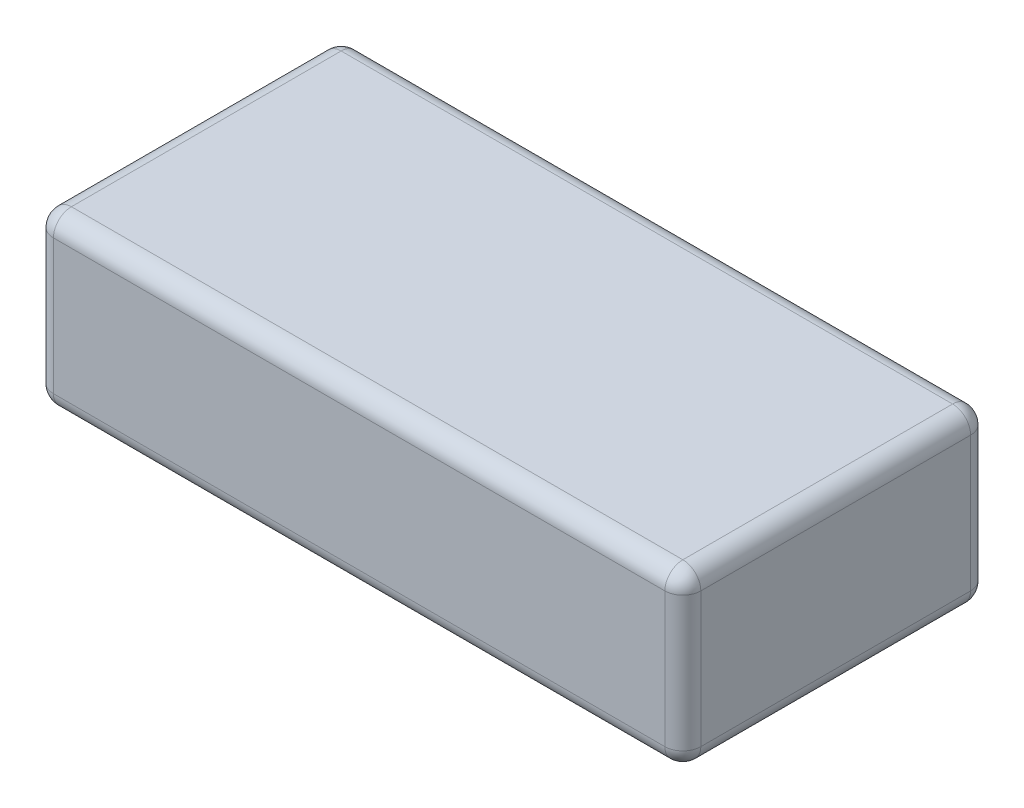
ISO-10303-21;
HEADER;
FILE_DESCRIPTION(('STEP AP214'),'2;1');
FILE_NAME('part.step','',(''),(''),'','','');
FILE_SCHEMA(('AUTOMOTIVE_DESIGN { 1 0 10303 214 1 1 1 1 }'));
ENDSEC;
DATA;
#1=APPLICATION_CONTEXT('core data for automotive mechanical design processes');
#2=APPLICATION_PROTOCOL_DEFINITION('international standard','automotive_design',2000,#1);
#3=PRODUCT_CONTEXT('',#1,'mechanical');
#4=PRODUCT('Part','Part','',(#3));
#5=PRODUCT_RELATED_PRODUCT_CATEGORY('part','',(#4));
#6=PRODUCT_DEFINITION_FORMATION('','',#4);
#7=PRODUCT_DEFINITION_CONTEXT('part definition',#1,'design');
#8=PRODUCT_DEFINITION('design','',#6,#7);
#9=PRODUCT_DEFINITION_SHAPE('','',#8);
#10=(LENGTH_UNIT() NAMED_UNIT(*) SI_UNIT(.MILLI.,.METRE.));
#11=(NAMED_UNIT(*) PLANE_ANGLE_UNIT() SI_UNIT($,.RADIAN.));
#12=(NAMED_UNIT(*) SI_UNIT($,.STERADIAN.) SOLID_ANGLE_UNIT());
#13=UNCERTAINTY_MEASURE_WITH_UNIT(LENGTH_MEASURE(1.E-05),#10,'distance_accuracy_value','');
#14=(GEOMETRIC_REPRESENTATION_CONTEXT(3) GLOBAL_UNCERTAINTY_ASSIGNED_CONTEXT((#13)) GLOBAL_UNIT_ASSIGNED_CONTEXT((#10,
#11,#12)) REPRESENTATION_CONTEXT('',''));
#15=CARTESIAN_POINT('',(0.,0.,0.));
#16=DIRECTION('',(0.,0.,1.));
#17=DIRECTION('',(1.,0.,0.));
#18=AXIS2_PLACEMENT_3D('',#15,#16,#17);
#19=CARTESIAN_POINT('',(36.,19.,17.));
#20=DIRECTION('',(-1.,0.,0.));
#21=DIRECTION('',(0.,0.,1.));
#22=AXIS2_PLACEMENT_3D('',#19,#20,#21);
#23=PLANE('',#22);
#24=DIRECTION('',(0.,0.,-1.));
#25=VECTOR('',#24,1.);
#26=CARTESIAN_POINT('',(36.,2.,-17.));
#27=LINE('',#26,#25);
#28=CARTESIAN_POINT('',(36.,2.,15.));
#29=VERTEX_POINT('',#28);
#30=CARTESIAN_POINT('',(36.,2.,-15.));
#31=VERTEX_POINT('',#30);
#32=EDGE_CURVE('E250',#29,#31,#27,.T.);
#33=ORIENTED_EDGE('',*,*,#32,.T.);
#34=DIRECTION('',(0.,-1.,0.));
#35=VECTOR('',#34,1.);
#36=CARTESIAN_POINT('',(36.,19.,-15.));
#37=LINE('',#36,#35);
#38=CARTESIAN_POINT('',(36.,17.,-15.));
#39=VERTEX_POINT('',#38);
#40=EDGE_CURVE('E255',#31,#39,#37,.F.);
#41=ORIENTED_EDGE('',*,*,#40,.T.);
#42=DIRECTION('',(0.,0.,-1.));
#43=VECTOR('',#42,1.);
#44=CARTESIAN_POINT('',(36.,17.,17.));
#45=LINE('',#44,#43);
#46=CARTESIAN_POINT('',(36.,17.,15.));
#47=VERTEX_POINT('',#46);
#48=EDGE_CURVE('E251',#39,#47,#45,.F.);
#49=ORIENTED_EDGE('',*,*,#48,.T.);
#50=DIRECTION('',(0.,-1.,0.));
#51=VECTOR('',#50,1.);
#52=CARTESIAN_POINT('',(36.,19.,15.));
#53=LINE('',#52,#51);
#54=EDGE_CURVE('E246',#47,#29,#53,.T.);
#55=ORIENTED_EDGE('',*,*,#54,.T.);
#56=EDGE_LOOP('',(#33,#41,#49,#55));
#57=FACE_BOUND('',#56,.T.);
#58=ADVANCED_FACE('F44',(#57),#23,.F.);
#59=CARTESIAN_POINT('',(-36.,19.,-17.));
#60=DIRECTION('',(0.,0.,1.));
#61=DIRECTION('',(1.,0.,0.));
#62=AXIS2_PLACEMENT_3D('',#59,#60,#61);
#63=PLANE('',#62);
#64=DIRECTION('',(0.,-1.,0.));
#65=VECTOR('',#64,1.);
#66=CARTESIAN_POINT('',(34.,19.,-17.));
#67=LINE('',#66,#65);
#68=CARTESIAN_POINT('',(34.,17.,-17.));
#69=VERTEX_POINT('',#68);
#70=CARTESIAN_POINT('',(34.,2.,-17.));
#71=VERTEX_POINT('',#70);
#72=EDGE_CURVE('E144',#69,#71,#67,.T.);
#73=ORIENTED_EDGE('',*,*,#72,.T.);
#74=DIRECTION('',(-1.,0.,0.));
#75=VECTOR('',#74,1.);
#76=CARTESIAN_POINT('',(-36.,2.,-17.));
#77=LINE('',#76,#75);
#78=CARTESIAN_POINT('',(-34.,2.,-17.));
#79=VERTEX_POINT('',#78);
#80=EDGE_CURVE('E139',#71,#79,#77,.T.);
#81=ORIENTED_EDGE('',*,*,#80,.T.);
#82=DIRECTION('',(0.,-1.,0.));
#83=VECTOR('',#82,1.);
#84=CARTESIAN_POINT('',(-34.,19.,-17.));
#85=LINE('',#84,#83);
#86=CARTESIAN_POINT('',(-34.,17.,-17.));
#87=VERTEX_POINT('',#86);
#88=EDGE_CURVE('E133',#79,#87,#85,.F.);
#89=ORIENTED_EDGE('',*,*,#88,.T.);
#90=DIRECTION('',(-1.,0.,0.));
#91=VECTOR('',#90,1.);
#92=CARTESIAN_POINT('',(-36.,17.,-17.));
#93=LINE('',#92,#91);
#94=EDGE_CURVE('E136',#87,#69,#93,.F.);
#95=ORIENTED_EDGE('',*,*,#94,.T.);
#96=EDGE_LOOP('',(#73,#81,#89,#95));
#97=FACE_BOUND('',#96,.T.);
#98=ADVANCED_FACE('F135',(#97),#63,.F.);
#99=CARTESIAN_POINT('',(-36.,19.,17.));
#100=DIRECTION('',(1.,0.,0.));
#101=DIRECTION('',(0.,0.,-1.));
#102=AXIS2_PLACEMENT_3D('',#99,#100,#101);
#103=PLANE('',#102);
#104=DIRECTION('',(0.,0.,1.));
#105=VECTOR('',#104,1.);
#106=CARTESIAN_POINT('',(-36.,17.,17.));
#107=LINE('',#106,#105);
#108=CARTESIAN_POINT('',(-36.,17.,15.));
#109=VERTEX_POINT('',#108);
#110=CARTESIAN_POINT('',(-36.,17.,-15.));
#111=VERTEX_POINT('',#110);
#112=EDGE_CURVE('E264',#109,#111,#107,.F.);
#113=ORIENTED_EDGE('',*,*,#112,.T.);
#114=DIRECTION('',(0.,-1.,0.));
#115=VECTOR('',#114,1.);
#116=CARTESIAN_POINT('',(-36.,19.,-15.));
#117=LINE('',#116,#115);
#118=CARTESIAN_POINT('',(-36.,2.,-15.));
#119=VERTEX_POINT('',#118);
#120=EDGE_CURVE('E168',#111,#119,#117,.T.);
#121=ORIENTED_EDGE('',*,*,#120,.T.);
#122=DIRECTION('',(0.,0.,1.));
#123=VECTOR('',#122,1.);
#124=CARTESIAN_POINT('',(-36.,2.,17.));
#125=LINE('',#124,#123);
#126=CARTESIAN_POINT('',(-36.,2.,15.));
#127=VERTEX_POINT('',#126);
#128=EDGE_CURVE('E270',#119,#127,#125,.T.);
#129=ORIENTED_EDGE('',*,*,#128,.T.);
#130=DIRECTION('',(0.,-1.,0.));
#131=VECTOR('',#130,1.);
#132=CARTESIAN_POINT('',(-36.,19.,15.));
#133=LINE('',#132,#131);
#134=EDGE_CURVE('E267',#127,#109,#133,.F.);
#135=ORIENTED_EDGE('',*,*,#134,.T.);
#136=EDGE_LOOP('',(#113,#121,#129,#135));
#137=FACE_BOUND('',#136,.T.);
#138=ADVANCED_FACE('F384',(#137),#103,.F.);
#139=CARTESIAN_POINT('',(-36.,19.,17.));
#140=DIRECTION('',(0.,0.,-1.));
#141=DIRECTION('',(-1.,0.,0.));
#142=AXIS2_PLACEMENT_3D('',#139,#140,#141);
#143=PLANE('',#142);
#144=DIRECTION('',(0.,-1.,0.));
#145=VECTOR('',#144,1.);
#146=CARTESIAN_POINT('',(-34.,19.,17.));
#147=LINE('',#146,#145);
#148=CARTESIAN_POINT('',(-34.,17.,17.));
#149=VERTEX_POINT('',#148);
#150=CARTESIAN_POINT('',(-34.,2.,17.));
#151=VERTEX_POINT('',#150);
#152=EDGE_CURVE('E280',#149,#151,#147,.T.);
#153=ORIENTED_EDGE('',*,*,#152,.T.);
#154=DIRECTION('',(1.,0.,0.));
#155=VECTOR('',#154,1.);
#156=CARTESIAN_POINT('',(36.,2.,17.));
#157=LINE('',#156,#155);
#158=CARTESIAN_POINT('',(34.,2.,17.));
#159=VERTEX_POINT('',#158);
#160=EDGE_CURVE('E284',#151,#159,#157,.T.);
#161=ORIENTED_EDGE('',*,*,#160,.T.);
#162=DIRECTION('',(0.,-1.,0.));
#163=VECTOR('',#162,1.);
#164=CARTESIAN_POINT('',(34.,19.,17.));
#165=LINE('',#164,#163);
#166=CARTESIAN_POINT('',(34.,17.,17.));
#167=VERTEX_POINT('',#166);
#168=EDGE_CURVE('E244',#159,#167,#165,.F.);
#169=ORIENTED_EDGE('',*,*,#168,.T.);
#170=DIRECTION('',(1.,0.,0.));
#171=VECTOR('',#170,1.);
#172=CARTESIAN_POINT('',(-36.,17.,17.));
#173=LINE('',#172,#171);
#174=EDGE_CURVE('E275',#167,#149,#173,.F.);
#175=ORIENTED_EDGE('',*,*,#174,.T.);
#176=EDGE_LOOP('',(#153,#161,#169,#175));
#177=FACE_BOUND('',#176,.T.);
#178=ADVANCED_FACE('F362',(#177),#143,.F.);
#179=CARTESIAN_POINT('',(0.,19.,0.));
#180=DIRECTION('',(0.,-1.,0.));
#181=DIRECTION('',(0.,0.,-1.));
#182=AXIS2_PLACEMENT_3D('',#179,#180,#181);
#183=PLANE('',#182);
#184=DIRECTION('',(0.,0.,1.));
#185=VECTOR('',#184,1.);
#186=CARTESIAN_POINT('',(-34.,19.,0.));
#187=LINE('',#186,#185);
#188=CARTESIAN_POINT('',(-34.,19.,-15.));
#189=VERTEX_POINT('',#188);
#190=CARTESIAN_POINT('',(-34.,19.,15.));
#191=VERTEX_POINT('',#190);
#192=EDGE_CURVE('E54',#189,#191,#187,.T.);
#193=ORIENTED_EDGE('',*,*,#192,.T.);
#194=DIRECTION('',(1.,0.,0.));
#195=VECTOR('',#194,1.);
#196=CARTESIAN_POINT('',(0.,19.,15.));
#197=LINE('',#196,#195);
#198=CARTESIAN_POINT('',(34.,19.,15.));
#199=VERTEX_POINT('',#198);
#200=EDGE_CURVE('E11',#191,#199,#197,.T.);
#201=ORIENTED_EDGE('',*,*,#200,.T.);
#202=DIRECTION('',(0.,0.,-1.));
#203=VECTOR('',#202,1.);
#204=CARTESIAN_POINT('',(34.,19.,0.));
#205=LINE('',#204,#203);
#206=CARTESIAN_POINT('',(34.,19.,-15.));
#207=VERTEX_POINT('',#206);
#208=EDGE_CURVE('E287',#199,#207,#205,.T.);
#209=ORIENTED_EDGE('',*,*,#208,.T.);
#210=DIRECTION('',(-1.,0.,0.));
#211=VECTOR('',#210,1.);
#212=CARTESIAN_POINT('',(0.,19.,-15.));
#213=LINE('',#212,#211);
#214=EDGE_CURVE('E65',#207,#189,#213,.T.);
#215=ORIENTED_EDGE('',*,*,#214,.T.);
#216=EDGE_LOOP('',(#193,#201,#209,#215));
#217=FACE_BOUND('',#216,.T.);
#218=ADVANCED_FACE('F352',(#217),#183,.F.);
#219=CARTESIAN_POINT('',(0.,0.,0.));
#220=DIRECTION('',(0.,-1.,0.));
#221=DIRECTION('',(0.,0.,-1.));
#222=AXIS2_PLACEMENT_3D('',#219,#220,#221);
#223=PLANE('',#222);
#224=DIRECTION('',(0.,0.,1.));
#225=VECTOR('',#224,1.);
#226=CARTESIAN_POINT('',(-34.,0.,-17.));
#227=LINE('',#226,#225);
#228=CARTESIAN_POINT('',(-34.,0.,15.));
#229=VERTEX_POINT('',#228);
#230=CARTESIAN_POINT('',(-34.,0.,-15.));
#231=VERTEX_POINT('',#230);
#232=EDGE_CURVE('E326',#229,#231,#227,.F.);
#233=ORIENTED_EDGE('',*,*,#232,.T.);
#234=DIRECTION('',(-1.,0.,0.));
#235=VECTOR('',#234,1.);
#236=CARTESIAN_POINT('',(36.,0.,-15.));
#237=LINE('',#236,#235);
#238=CARTESIAN_POINT('',(34.,0.,-15.));
#239=VERTEX_POINT('',#238);
#240=EDGE_CURVE('E257',#231,#239,#237,.F.);
#241=ORIENTED_EDGE('',*,*,#240,.T.);
#242=DIRECTION('',(0.,0.,-1.));
#243=VECTOR('',#242,1.);
#244=CARTESIAN_POINT('',(34.,0.,17.));
#245=LINE('',#244,#243);
#246=CARTESIAN_POINT('',(34.,0.,15.));
#247=VERTEX_POINT('',#246);
#248=EDGE_CURVE('E320',#239,#247,#245,.F.);
#249=ORIENTED_EDGE('',*,*,#248,.T.);
#250=DIRECTION('',(1.,0.,0.));
#251=VECTOR('',#250,1.);
#252=CARTESIAN_POINT('',(-36.,0.,15.));
#253=LINE('',#252,#251);
#254=EDGE_CURVE('E338',#247,#229,#253,.F.);
#255=ORIENTED_EDGE('',*,*,#254,.T.);
#256=EDGE_LOOP('',(#233,#241,#249,#255));
#257=FACE_BOUND('',#256,.T.);
#258=ADVANCED_FACE('F329',(#257),#223,.T.);
#259=CARTESIAN_POINT('',(0.,17.,15.));
#260=DIRECTION('',(1.,0.,0.));
#261=DIRECTION('',(0.,0.,-1.));
#262=AXIS2_PLACEMENT_3D('',#259,#260,#261);
#263=CYLINDRICAL_SURFACE('',#262,2.);
#264=CARTESIAN_POINT('',(34.,17.,15.));
#265=DIRECTION('',(1.,0.,0.));
#266=DIRECTION('',(0.,0.,-1.));
#267=AXIS2_PLACEMENT_3D('',#264,#265,#266);
#268=CIRCLE('',#267,2.);
#269=EDGE_CURVE('E48',#199,#167,#268,.T.);
#270=ORIENTED_EDGE('',*,*,#269,.F.);
#271=ORIENTED_EDGE('',*,*,#200,.F.);
#272=CARTESIAN_POINT('',(-34.,17.,15.));
#273=DIRECTION('',(-1.,0.,0.));
#274=DIRECTION('',(0.,0.,1.));
#275=AXIS2_PLACEMENT_3D('',#272,#273,#274);
#276=CIRCLE('',#275,2.);
#277=EDGE_CURVE('E223',#149,#191,#276,.T.);
#278=ORIENTED_EDGE('',*,*,#277,.F.);
#279=ORIENTED_EDGE('',*,*,#174,.F.);
#280=EDGE_LOOP('',(#270,#271,#278,#279));
#281=FACE_BOUND('',#280,.T.);
#282=ADVANCED_FACE('F46',(#281),#263,.T.);
#283=CARTESIAN_POINT('',(34.,17.,15.));
#284=DIRECTION('',(0.,0.,1.));
#285=DIRECTION('',(1.,0.,0.));
#286=AXIS2_PLACEMENT_3D('',#283,#284,#285);
#287=SPHERICAL_SURFACE('',#286,2.);
#288=CARTESIAN_POINT('',(34.,17.,15.));
#289=DIRECTION('',(0.,0.,1.));
#290=DIRECTION('',(1.,0.,0.));
#291=AXIS2_PLACEMENT_3D('',#288,#289,#290);
#292=CIRCLE('',#291,2.);
#293=EDGE_CURVE('E216',#199,#47,#292,.F.);
#294=ORIENTED_EDGE('',*,*,#293,.F.);
#295=ORIENTED_EDGE('',*,*,#269,.T.);
#296=CARTESIAN_POINT('',(34.,17.,15.));
#297=DIRECTION('',(0.,1.,0.));
#298=DIRECTION('',(0.,0.,1.));
#299=AXIS2_PLACEMENT_3D('',#296,#297,#298);
#300=CIRCLE('',#299,2.);
#301=EDGE_CURVE('E220',#47,#167,#300,.F.);
#302=ORIENTED_EDGE('',*,*,#301,.F.);
#303=EDGE_LOOP('',(#294,#295,#302));
#304=FACE_BOUND('',#303,.T.);
#305=ADVANCED_FACE('F236',(#304),#287,.T.);
#306=CARTESIAN_POINT('',(-34.,17.,15.));
#307=DIRECTION('',(0.,1.,0.));
#308=DIRECTION('',(0.,0.,1.));
#309=AXIS2_PLACEMENT_3D('',#306,#307,#308);
#310=SPHERICAL_SURFACE('',#309,2.);
#311=CARTESIAN_POINT('',(-34.,17.,15.));
#312=DIRECTION('',(0.,1.,0.));
#313=DIRECTION('',(0.,0.,1.));
#314=AXIS2_PLACEMENT_3D('',#311,#312,#313);
#315=CIRCLE('',#314,2.);
#316=EDGE_CURVE('E208',#149,#109,#315,.F.);
#317=ORIENTED_EDGE('',*,*,#316,.F.);
#318=ORIENTED_EDGE('',*,*,#277,.T.);
#319=CARTESIAN_POINT('',(-34.,17.,15.));
#320=DIRECTION('',(0.,0.,1.));
#321=DIRECTION('',(1.,0.,0.));
#322=AXIS2_PLACEMENT_3D('',#319,#320,#321);
#323=CIRCLE('',#322,2.);
#324=EDGE_CURVE('E212',#109,#191,#323,.F.);
#325=ORIENTED_EDGE('',*,*,#324,.F.);
#326=EDGE_LOOP('',(#317,#318,#325));
#327=FACE_BOUND('',#326,.T.);
#328=ADVANCED_FACE('F354',(#327),#310,.T.);
#329=CARTESIAN_POINT('',(34.,19.,15.));
#330=DIRECTION('',(0.,-1.,0.));
#331=DIRECTION('',(0.,0.,-1.));
#332=AXIS2_PLACEMENT_3D('',#329,#330,#331);
#333=CYLINDRICAL_SURFACE('',#332,2.);
#334=ORIENTED_EDGE('',*,*,#301,.T.);
#335=ORIENTED_EDGE('',*,*,#168,.F.);
#336=CARTESIAN_POINT('',(34.,2.,15.));
#337=DIRECTION('',(0.,-1.,0.));
#338=DIRECTION('',(0.,0.,-1.));
#339=AXIS2_PLACEMENT_3D('',#336,#337,#338);
#340=CIRCLE('',#339,2.);
#341=EDGE_CURVE('E200',#29,#159,#340,.T.);
#342=ORIENTED_EDGE('',*,*,#341,.F.);
#343=ORIENTED_EDGE('',*,*,#54,.F.);
#344=EDGE_LOOP('',(#334,#335,#342,#343));
#345=FACE_BOUND('',#344,.T.);
#346=ADVANCED_FACE('F242',(#345),#333,.T.);
#347=CARTESIAN_POINT('',(34.,17.,0.));
#348=DIRECTION('',(0.,0.,-1.));
#349=DIRECTION('',(-1.,0.,0.));
#350=AXIS2_PLACEMENT_3D('',#347,#348,#349);
#351=CYLINDRICAL_SURFACE('',#350,2.);
#352=ORIENTED_EDGE('',*,*,#293,.T.);
#353=ORIENTED_EDGE('',*,*,#48,.F.);
#354=CARTESIAN_POINT('',(34.,17.,-15.));
#355=DIRECTION('',(0.,0.,-1.));
#356=DIRECTION('',(-1.,0.,0.));
#357=AXIS2_PLACEMENT_3D('',#354,#355,#356);
#358=CIRCLE('',#357,2.);
#359=EDGE_CURVE('E196',#207,#39,#358,.T.);
#360=ORIENTED_EDGE('',*,*,#359,.F.);
#361=ORIENTED_EDGE('',*,*,#208,.F.);
#362=EDGE_LOOP('',(#352,#353,#360,#361));
#363=FACE_BOUND('',#362,.T.);
#364=ADVANCED_FACE('F351',(#363),#351,.T.);
#365=CARTESIAN_POINT('',(0.,17.,-15.));
#366=DIRECTION('',(-1.,0.,0.));
#367=DIRECTION('',(0.,0.,1.));
#368=AXIS2_PLACEMENT_3D('',#365,#366,#367);
#369=CYLINDRICAL_SURFACE('',#368,2.);
#370=CARTESIAN_POINT('',(-34.,17.,-15.));
#371=DIRECTION('',(-1.,0.,0.));
#372=DIRECTION('',(0.,0.,1.));
#373=AXIS2_PLACEMENT_3D('',#370,#371,#372);
#374=CIRCLE('',#373,2.);
#375=EDGE_CURVE('E150',#189,#87,#374,.T.);
#376=ORIENTED_EDGE('',*,*,#375,.F.);
#377=ORIENTED_EDGE('',*,*,#214,.F.);
#378=CARTESIAN_POINT('',(34.,17.,-15.));
#379=DIRECTION('',(1.,0.,0.));
#380=DIRECTION('',(0.,0.,-1.));
#381=AXIS2_PLACEMENT_3D('',#378,#379,#380);
#382=CIRCLE('',#381,2.);
#383=EDGE_CURVE('E153',#69,#207,#382,.T.);
#384=ORIENTED_EDGE('',*,*,#383,.F.);
#385=ORIENTED_EDGE('',*,*,#94,.F.);
#386=EDGE_LOOP('',(#376,#377,#384,#385));
#387=FACE_BOUND('',#386,.T.);
#388=ADVANCED_FACE('F149',(#387),#369,.T.);
#389=CARTESIAN_POINT('',(-34.,17.,0.));
#390=DIRECTION('',(0.,0.,1.));
#391=DIRECTION('',(1.,0.,0.));
#392=AXIS2_PLACEMENT_3D('',#389,#390,#391);
#393=CYLINDRICAL_SURFACE('',#392,2.);
#394=ORIENTED_EDGE('',*,*,#324,.T.);
#395=ORIENTED_EDGE('',*,*,#192,.F.);
#396=CARTESIAN_POINT('',(-34.,17.,-15.));
#397=DIRECTION('',(0.,0.,-1.));
#398=DIRECTION('',(0.,1.,0.));
#399=AXIS2_PLACEMENT_3D('',#396,#397,#398);
#400=CIRCLE('',#399,2.);
#401=EDGE_CURVE('E163',#111,#189,#400,.T.);
#402=ORIENTED_EDGE('',*,*,#401,.F.);
#403=ORIENTED_EDGE('',*,*,#112,.F.);
#404=EDGE_LOOP('',(#394,#395,#402,#403));
#405=FACE_BOUND('',#404,.T.);
#406=ADVANCED_FACE('F512',(#405),#393,.T.);
#407=CARTESIAN_POINT('',(-34.,19.,15.));
#408=DIRECTION('',(0.,-1.,0.));
#409=DIRECTION('',(0.,0.,-1.));
#410=AXIS2_PLACEMENT_3D('',#407,#408,#409);
#411=CYLINDRICAL_SURFACE('',#410,2.);
#412=ORIENTED_EDGE('',*,*,#316,.T.);
#413=ORIENTED_EDGE('',*,*,#134,.F.);
#414=CARTESIAN_POINT('',(-34.,2.,15.));
#415=DIRECTION('',(0.,-1.,0.));
#416=DIRECTION('',(0.,0.,-1.));
#417=AXIS2_PLACEMENT_3D('',#414,#415,#416);
#418=CIRCLE('',#417,2.);
#419=EDGE_CURVE('E188',#151,#127,#418,.T.);
#420=ORIENTED_EDGE('',*,*,#419,.F.);
#421=ORIENTED_EDGE('',*,*,#152,.F.);
#422=EDGE_LOOP('',(#412,#413,#420,#421));
#423=FACE_BOUND('',#422,.T.);
#424=ADVANCED_FACE('F359',(#423),#411,.T.);
#425=CARTESIAN_POINT('',(-36.,2.,15.));
#426=DIRECTION('',(-1.,0.,0.));
#427=DIRECTION('',(0.,0.,1.));
#428=AXIS2_PLACEMENT_3D('',#425,#426,#427);
#429=CYLINDRICAL_SURFACE('',#428,2.);
#430=CARTESIAN_POINT('',(34.,2.,15.));
#431=DIRECTION('',(1.,0.,0.));
#432=DIRECTION('',(0.,0.,-1.));
#433=AXIS2_PLACEMENT_3D('',#430,#431,#432);
#434=CIRCLE('',#433,2.);
#435=EDGE_CURVE('E204',#159,#247,#434,.T.);
#436=ORIENTED_EDGE('',*,*,#435,.F.);
#437=ORIENTED_EDGE('',*,*,#160,.F.);
#438=CARTESIAN_POINT('',(-34.,2.,15.));
#439=DIRECTION('',(-1.,0.,0.));
#440=DIRECTION('',(0.,0.,1.));
#441=AXIS2_PLACEMENT_3D('',#438,#439,#440);
#442=CIRCLE('',#441,2.);
#443=EDGE_CURVE('E185',#229,#151,#442,.T.);
#444=ORIENTED_EDGE('',*,*,#443,.F.);
#445=ORIENTED_EDGE('',*,*,#254,.F.);
#446=EDGE_LOOP('',(#436,#437,#444,#445));
#447=FACE_BOUND('',#446,.T.);
#448=ADVANCED_FACE('F365',(#447),#429,.T.);
#449=CARTESIAN_POINT('',(34.,2.,15.));
#450=DIRECTION('',(0.,0.,1.));
#451=DIRECTION('',(0.,-1.,0.));
#452=AXIS2_PLACEMENT_3D('',#449,#450,#451);
#453=SPHERICAL_SURFACE('',#452,2.);
#454=ORIENTED_EDGE('',*,*,#341,.T.);
#455=ORIENTED_EDGE('',*,*,#435,.T.);
#456=CARTESIAN_POINT('',(34.,2.,15.));
#457=DIRECTION('',(0.,0.,1.));
#458=DIRECTION('',(1.,0.,0.));
#459=AXIS2_PLACEMENT_3D('',#456,#457,#458);
#460=CIRCLE('',#459,2.);
#461=EDGE_CURVE('E175',#29,#247,#460,.F.);
#462=ORIENTED_EDGE('',*,*,#461,.F.);
#463=EDGE_LOOP('',(#454,#455,#462));
#464=FACE_BOUND('',#463,.T.);
#465=ADVANCED_FACE('F368',(#464),#453,.T.);
#466=CARTESIAN_POINT('',(34.,17.,-15.));
#467=DIRECTION('',(0.,1.,0.));
#468=DIRECTION('',(0.,0.,1.));
#469=AXIS2_PLACEMENT_3D('',#466,#467,#468);
#470=SPHERICAL_SURFACE('',#469,2.);
#471=ORIENTED_EDGE('',*,*,#383,.T.);
#472=ORIENTED_EDGE('',*,*,#359,.T.);
#473=CARTESIAN_POINT('',(34.,17.,-15.));
#474=DIRECTION('',(0.,1.,0.));
#475=DIRECTION('',(0.,0.,1.));
#476=AXIS2_PLACEMENT_3D('',#473,#474,#475);
#477=CIRCLE('',#476,2.);
#478=EDGE_CURVE('E170',#69,#39,#477,.F.);
#479=ORIENTED_EDGE('',*,*,#478,.F.);
#480=EDGE_LOOP('',(#471,#472,#479));
#481=FACE_BOUND('',#480,.T.);
#482=ADVANCED_FACE('F370',(#481),#470,.T.);
#483=CARTESIAN_POINT('',(-34.,17.,-15.));
#484=DIRECTION('',(0.,1.,0.));
#485=DIRECTION('',(0.,0.,1.));
#486=AXIS2_PLACEMENT_3D('',#483,#484,#485);
#487=SPHERICAL_SURFACE('',#486,2.);
#488=ORIENTED_EDGE('',*,*,#401,.T.);
#489=ORIENTED_EDGE('',*,*,#375,.T.);
#490=CARTESIAN_POINT('',(-34.,17.,-15.));
#491=DIRECTION('',(0.,1.,0.));
#492=DIRECTION('',(0.,0.,1.));
#493=AXIS2_PLACEMENT_3D('',#490,#491,#492);
#494=CIRCLE('',#493,2.);
#495=EDGE_CURVE('E160',#111,#87,#494,.F.);
#496=ORIENTED_EDGE('',*,*,#495,.F.);
#497=EDGE_LOOP('',(#488,#489,#496));
#498=FACE_BOUND('',#497,.T.);
#499=ADVANCED_FACE('F159',(#498),#487,.T.);
#500=CARTESIAN_POINT('',(-34.,2.,15.));
#501=DIRECTION('',(0.,0.,1.));
#502=DIRECTION('',(0.,-1.,0.));
#503=AXIS2_PLACEMENT_3D('',#500,#501,#502);
#504=SPHERICAL_SURFACE('',#503,2.);
#505=ORIENTED_EDGE('',*,*,#443,.T.);
#506=ORIENTED_EDGE('',*,*,#419,.T.);
#507=CARTESIAN_POINT('',(-34.,2.,15.));
#508=DIRECTION('',(0.,0.,1.));
#509=DIRECTION('',(1.,0.,0.));
#510=AXIS2_PLACEMENT_3D('',#507,#508,#509);
#511=CIRCLE('',#510,2.);
#512=EDGE_CURVE('E171',#229,#127,#511,.F.);
#513=ORIENTED_EDGE('',*,*,#512,.F.);
#514=EDGE_LOOP('',(#505,#506,#513));
#515=FACE_BOUND('',#514,.T.);
#516=ADVANCED_FACE('F407',(#515),#504,.T.);
#517=CARTESIAN_POINT('',(34.,2.,17.));
#518=DIRECTION('',(0.,0.,1.));
#519=DIRECTION('',(1.,0.,0.));
#520=AXIS2_PLACEMENT_3D('',#517,#518,#519);
#521=CYLINDRICAL_SURFACE('',#520,2.);
#522=ORIENTED_EDGE('',*,*,#461,.T.);
#523=ORIENTED_EDGE('',*,*,#248,.F.);
#524=CARTESIAN_POINT('',(34.,2.,-15.));
#525=DIRECTION('',(0.,0.,-1.));
#526=DIRECTION('',(-1.,0.,0.));
#527=AXIS2_PLACEMENT_3D('',#524,#525,#526);
#528=CIRCLE('',#527,2.);
#529=EDGE_CURVE('E178',#31,#239,#528,.T.);
#530=ORIENTED_EDGE('',*,*,#529,.F.);
#531=ORIENTED_EDGE('',*,*,#32,.F.);
#532=EDGE_LOOP('',(#522,#523,#530,#531));
#533=FACE_BOUND('',#532,.T.);
#534=ADVANCED_FACE('F322',(#533),#521,.T.);
#535=CARTESIAN_POINT('',(34.,19.,-15.));
#536=DIRECTION('',(0.,-1.,0.));
#537=DIRECTION('',(0.,0.,-1.));
#538=AXIS2_PLACEMENT_3D('',#535,#536,#537);
#539=CYLINDRICAL_SURFACE('',#538,2.);
#540=ORIENTED_EDGE('',*,*,#478,.T.);
#541=ORIENTED_EDGE('',*,*,#40,.F.);
#542=CARTESIAN_POINT('',(34.,2.,-15.));
#543=DIRECTION('',(0.,-1.,0.));
#544=DIRECTION('',(0.,0.,-1.));
#545=AXIS2_PLACEMENT_3D('',#542,#543,#544);
#546=CIRCLE('',#545,2.);
#547=EDGE_CURVE('E307',#71,#31,#546,.T.);
#548=ORIENTED_EDGE('',*,*,#547,.F.);
#549=ORIENTED_EDGE('',*,*,#72,.F.);
#550=EDGE_LOOP('',(#540,#541,#548,#549));
#551=FACE_BOUND('',#550,.T.);
#552=ADVANCED_FACE('F347',(#551),#539,.T.);
#553=CARTESIAN_POINT('',(-34.,19.,-15.));
#554=DIRECTION('',(0.,-1.,0.));
#555=DIRECTION('',(0.,0.,-1.));
#556=AXIS2_PLACEMENT_3D('',#553,#554,#555);
#557=CYLINDRICAL_SURFACE('',#556,2.);
#558=ORIENTED_EDGE('',*,*,#495,.T.);
#559=ORIENTED_EDGE('',*,*,#88,.F.);
#560=CARTESIAN_POINT('',(-34.,2.,-15.));
#561=DIRECTION('',(0.,-1.,0.));
#562=DIRECTION('',(0.,0.,-1.));
#563=AXIS2_PLACEMENT_3D('',#560,#561,#562);
#564=CIRCLE('',#563,2.);
#565=EDGE_CURVE('E303',#119,#79,#564,.T.);
#566=ORIENTED_EDGE('',*,*,#565,.F.);
#567=ORIENTED_EDGE('',*,*,#120,.F.);
#568=EDGE_LOOP('',(#558,#559,#566,#567));
#569=FACE_BOUND('',#568,.T.);
#570=ADVANCED_FACE('F166',(#569),#557,.T.);
#571=CARTESIAN_POINT('',(-34.,2.,17.));
#572=DIRECTION('',(0.,0.,-1.));
#573=DIRECTION('',(-1.,0.,0.));
#574=AXIS2_PLACEMENT_3D('',#571,#572,#573);
#575=CYLINDRICAL_SURFACE('',#574,2.);
#576=ORIENTED_EDGE('',*,*,#512,.T.);
#577=ORIENTED_EDGE('',*,*,#128,.F.);
#578=CARTESIAN_POINT('',(-34.,2.,-15.));
#579=DIRECTION('',(0.,0.,-1.));
#580=DIRECTION('',(-1.,0.,0.));
#581=AXIS2_PLACEMENT_3D('',#578,#579,#580);
#582=CIRCLE('',#581,2.);
#583=EDGE_CURVE('E300',#231,#119,#582,.T.);
#584=ORIENTED_EDGE('',*,*,#583,.F.);
#585=ORIENTED_EDGE('',*,*,#232,.F.);
#586=EDGE_LOOP('',(#576,#577,#584,#585));
#587=FACE_BOUND('',#586,.T.);
#588=ADVANCED_FACE('F397',(#587),#575,.T.);
#589=CARTESIAN_POINT('',(34.,2.,-15.));
#590=DIRECTION('',(1.,0.,0.));
#591=DIRECTION('',(0.,1.,0.));
#592=AXIS2_PLACEMENT_3D('',#589,#590,#591);
#593=SPHERICAL_SURFACE('',#592,2.);
#594=ORIENTED_EDGE('',*,*,#547,.T.);
#595=ORIENTED_EDGE('',*,*,#529,.T.);
#596=CARTESIAN_POINT('',(34.,2.,-15.));
#597=DIRECTION('',(1.,0.,0.));
#598=DIRECTION('',(0.,0.,-1.));
#599=AXIS2_PLACEMENT_3D('',#596,#597,#598);
#600=CIRCLE('',#599,2.);
#601=EDGE_CURVE('E297',#71,#239,#600,.F.);
#602=ORIENTED_EDGE('',*,*,#601,.F.);
#603=EDGE_LOOP('',(#594,#595,#602));
#604=FACE_BOUND('',#603,.T.);
#605=ADVANCED_FACE('F316',(#604),#593,.T.);
#606=CARTESIAN_POINT('',(-34.,2.,-15.));
#607=DIRECTION('',(-1.,0.,0.));
#608=DIRECTION('',(0.,0.,1.));
#609=AXIS2_PLACEMENT_3D('',#606,#607,#608);
#610=SPHERICAL_SURFACE('',#609,2.);
#611=ORIENTED_EDGE('',*,*,#583,.T.);
#612=ORIENTED_EDGE('',*,*,#565,.T.);
#613=CARTESIAN_POINT('',(-34.,2.,-15.));
#614=DIRECTION('',(-1.,0.,0.));
#615=DIRECTION('',(0.,0.,1.));
#616=AXIS2_PLACEMENT_3D('',#613,#614,#615);
#617=CIRCLE('',#616,2.);
#618=EDGE_CURVE('E294',#231,#79,#617,.F.);
#619=ORIENTED_EDGE('',*,*,#618,.F.);
#620=EDGE_LOOP('',(#611,#612,#619));
#621=FACE_BOUND('',#620,.T.);
#622=ADVANCED_FACE('F391',(#621),#610,.T.);
#623=CARTESIAN_POINT('',(-36.,2.,-15.));
#624=DIRECTION('',(1.,0.,0.));
#625=DIRECTION('',(0.,0.,-1.));
#626=AXIS2_PLACEMENT_3D('',#623,#624,#625);
#627=CYLINDRICAL_SURFACE('',#626,2.);
#628=ORIENTED_EDGE('',*,*,#601,.T.);
#629=ORIENTED_EDGE('',*,*,#240,.F.);
#630=ORIENTED_EDGE('',*,*,#618,.T.);
#631=ORIENTED_EDGE('',*,*,#80,.F.);
#632=EDGE_LOOP('',(#628,#629,#630,#631));
#633=FACE_BOUND('',#632,.T.);
#634=ADVANCED_FACE('F388',(#633),#627,.T.);
#635=CLOSED_SHELL('',(#58,#98,#138,#178,#218,#258,#282,#305,#328,#346,#364,#388,#406,#424,#448,
#465,#482,#499,#516,#534,#552,#570,#588,#605,#622,#634));
#636=MANIFOLD_SOLID_BREP('B2',#635);
#637=ADVANCED_BREP_SHAPE_REPRESENTATION('',(#18,#636),#14);
#638=SHAPE_DEFINITION_REPRESENTATION(#9,#637);
ENDSEC;
END-ISO-10303-21;
